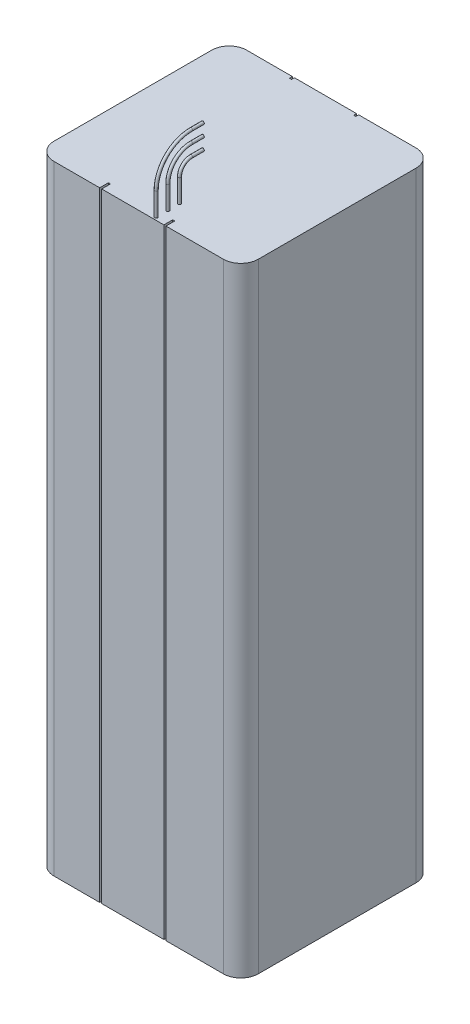
ISO-10303-21;
HEADER;
FILE_DESCRIPTION(('STEP AP214'),'2;1');
FILE_NAME('part.step','',(''),(''),'','','');
FILE_SCHEMA(('AUTOMOTIVE_DESIGN { 1 0 10303 214 1 1 1 1 }'));
ENDSEC;
DATA;
#1=APPLICATION_CONTEXT('core data for automotive mechanical design processes');
#2=APPLICATION_PROTOCOL_DEFINITION('international standard','automotive_design',2000,#1);
#3=PRODUCT_CONTEXT('',#1,'mechanical');
#4=PRODUCT('Part','Part','',(#3));
#5=PRODUCT_RELATED_PRODUCT_CATEGORY('part','',(#4));
#6=PRODUCT_DEFINITION_FORMATION('','',#4);
#7=PRODUCT_DEFINITION_CONTEXT('part definition',#1,'design');
#8=PRODUCT_DEFINITION('design','',#6,#7);
#9=PRODUCT_DEFINITION_SHAPE('','',#8);
#10=(LENGTH_UNIT() NAMED_UNIT(*) SI_UNIT(.MILLI.,.METRE.));
#11=(NAMED_UNIT(*) PLANE_ANGLE_UNIT() SI_UNIT($,.RADIAN.));
#12=(NAMED_UNIT(*) SI_UNIT($,.STERADIAN.) SOLID_ANGLE_UNIT());
#13=UNCERTAINTY_MEASURE_WITH_UNIT(LENGTH_MEASURE(1.E-05),#10,'distance_accuracy_value','');
#14=(GEOMETRIC_REPRESENTATION_CONTEXT(3) GLOBAL_UNCERTAINTY_ASSIGNED_CONTEXT((#13)) GLOBAL_UNIT_ASSIGNED_CONTEXT((#10,
#11,#12)) REPRESENTATION_CONTEXT('',''));
#15=CARTESIAN_POINT('',(0.,0.,0.));
#16=DIRECTION('',(0.,0.,1.));
#17=DIRECTION('',(1.,0.,0.));
#18=AXIS2_PLACEMENT_3D('',#15,#16,#17);
#19=CARTESIAN_POINT('',(20.,108.,-7.5));
#20=DIRECTION('',(0.,0.,1.));
#21=DIRECTION('',(1.,0.,0.));
#22=AXIS2_PLACEMENT_3D('',#19,#20,#21);
#23=PLANE('',#22);
#24=CARTESIAN_POINT('',(20.,108.,-7.5));
#25=DIRECTION('',(0.,0.,1.));
#26=DIRECTION('',(1.,0.,0.));
#27=AXIS2_PLACEMENT_3D('',#24,#25,#26);
#28=CIRCLE('',#27,0.25);
#29=CARTESIAN_POINT('',(20.25,108.,-7.5));
#30=VERTEX_POINT('',#29);
#31=EDGE_CURVE('E20',#30,#30,#28,.T.);
#32=ORIENTED_EDGE('',*,*,#31,.F.);
#33=EDGE_LOOP('',(#32));
#34=FACE_BOUND('',#33,.T.);
#35=ADVANCED_FACE('F17',(#34),#23,.F.);
#36=CARTESIAN_POINT('',(20.,106.,-7.5));
#37=DIRECTION('',(0.,0.,1.));
#38=DIRECTION('',(1.,0.,0.));
#39=AXIS2_PLACEMENT_3D('',#36,#37,#38);
#40=PLANE('',#39);
#41=CARTESIAN_POINT('',(20.,106.,-7.5));
#42=DIRECTION('',(0.,0.,1.));
#43=DIRECTION('',(1.,0.,0.));
#44=AXIS2_PLACEMENT_3D('',#41,#42,#43);
#45=CIRCLE('',#44,0.25);
#46=CARTESIAN_POINT('',(20.25,106.,-7.5));
#47=VERTEX_POINT('',#46);
#48=EDGE_CURVE('E384',#47,#47,#45,.T.);
#49=ORIENTED_EDGE('',*,*,#48,.F.);
#50=EDGE_LOOP('',(#49));
#51=FACE_BOUND('',#50,.T.);
#52=ADVANCED_FACE('F394',(#51),#40,.F.);
#53=CARTESIAN_POINT('',(20.,104.,-7.5));
#54=DIRECTION('',(0.,0.,1.));
#55=DIRECTION('',(1.,0.,0.));
#56=AXIS2_PLACEMENT_3D('',#53,#54,#55);
#57=PLANE('',#56);
#58=CARTESIAN_POINT('',(20.,104.,-7.5));
#59=DIRECTION('',(0.,0.,1.));
#60=DIRECTION('',(1.,0.,0.));
#61=AXIS2_PLACEMENT_3D('',#58,#59,#60);
#62=CIRCLE('',#61,0.25);
#63=CARTESIAN_POINT('',(20.25,104.,-7.5));
#64=VERTEX_POINT('',#63);
#65=EDGE_CURVE('E302',#64,#64,#62,.T.);
#66=ORIENTED_EDGE('',*,*,#65,.F.);
#67=EDGE_LOOP('',(#66));
#68=FACE_BOUND('',#67,.T.);
#69=ADVANCED_FACE('F399',(#68),#57,.F.);
#70=CARTESIAN_POINT('',(20.,108.,-7.5));
#71=DIRECTION('',(0.,0.,1.));
#72=DIRECTION('',(1.,0.,0.));
#73=AXIS2_PLACEMENT_3D('',#70,#71,#72);
#74=CYLINDRICAL_SURFACE('',#73,0.25);
#75=CARTESIAN_POINT('',(20.,108.,-5.5));
#76=DIRECTION('',(0.,0.,1.));
#77=DIRECTION('',(0.,1.,0.));
#78=AXIS2_PLACEMENT_3D('',#75,#76,#77);
#79=CIRCLE('',#78,0.25);
#80=CARTESIAN_POINT('',(20.,108.25,-5.5));
#81=VERTEX_POINT('',#80);
#82=EDGE_CURVE('E299',#81,#81,#79,.T.);
#83=ORIENTED_EDGE('',*,*,#82,.F.);
#84=EDGE_LOOP('',(#83));
#85=FACE_BOUND('',#84,.T.);
#86=ORIENTED_EDGE('',*,*,#31,.T.);
#87=EDGE_LOOP('',(#86));
#88=FACE_BOUND('',#87,.T.);
#89=ADVANCED_FACE('F391',(#85,#88),#74,.T.);
#90=CARTESIAN_POINT('',(20.,106.,-7.5));
#91=DIRECTION('',(0.,0.,1.));
#92=DIRECTION('',(1.,0.,0.));
#93=AXIS2_PLACEMENT_3D('',#90,#91,#92);
#94=CYLINDRICAL_SURFACE('',#93,0.25);
#95=CARTESIAN_POINT('',(20.,106.,-5.5));
#96=DIRECTION('',(0.,0.,1.));
#97=DIRECTION('',(0.,1.,0.));
#98=AXIS2_PLACEMENT_3D('',#95,#96,#97);
#99=CIRCLE('',#98,0.25);
#100=CARTESIAN_POINT('',(20.,106.25,-5.5));
#101=VERTEX_POINT('',#100);
#102=EDGE_CURVE('E296',#101,#101,#99,.T.);
#103=ORIENTED_EDGE('',*,*,#102,.F.);
#104=EDGE_LOOP('',(#103));
#105=FACE_BOUND('',#104,.T.);
#106=ORIENTED_EDGE('',*,*,#48,.T.);
#107=EDGE_LOOP('',(#106));
#108=FACE_BOUND('',#107,.T.);
#109=ADVANCED_FACE('F688',(#105,#108),#94,.T.);
#110=CARTESIAN_POINT('',(20.,104.,-7.5));
#111=DIRECTION('',(0.,0.,1.));
#112=DIRECTION('',(1.,0.,0.));
#113=AXIS2_PLACEMENT_3D('',#110,#111,#112);
#114=CYLINDRICAL_SURFACE('',#113,0.25);
#115=CARTESIAN_POINT('',(20.,104.,-5.5));
#116=DIRECTION('',(0.,0.,1.));
#117=DIRECTION('',(0.,1.,0.));
#118=AXIS2_PLACEMENT_3D('',#115,#116,#117);
#119=CIRCLE('',#118,0.25);
#120=CARTESIAN_POINT('',(20.,104.25,-5.5));
#121=VERTEX_POINT('',#120);
#122=EDGE_CURVE('E178',#121,#121,#119,.T.);
#123=ORIENTED_EDGE('',*,*,#122,.F.);
#124=EDGE_LOOP('',(#123));
#125=FACE_BOUND('',#124,.T.);
#126=ORIENTED_EDGE('',*,*,#65,.T.);
#127=EDGE_LOOP('',(#126));
#128=FACE_BOUND('',#127,.T.);
#129=ADVANCED_FACE('F683',(#125,#128),#114,.T.);
#130=CARTESIAN_POINT('',(0.,0.,-0.5));
#131=DIRECTION('',(0.,0.,1.));
#132=DIRECTION('',(1.,0.,0.));
#133=AXIS2_PLACEMENT_3D('',#130,#131,#132);
#134=PLANE('',#133);
#135=DIRECTION('',(1.,0.,0.));
#136=VECTOR('',#135,1.);
#137=CARTESIAN_POINT('',(0.,98.,-0.5));
#138=LINE('',#137,#136);
#139=CARTESIAN_POINT('',(11.175,98.,-0.5));
#140=VERTEX_POINT('',#139);
#141=CARTESIAN_POINT('',(10.825,98.,-0.5));
#142=VERTEX_POINT('',#141);
#143=EDGE_CURVE('E177',#140,#142,#138,.F.);
#144=ORIENTED_EDGE('',*,*,#143,.T.);
#145=DIRECTION('',(0.,1.,0.));
#146=VECTOR('',#145,1.);
#147=CARTESIAN_POINT('',(10.825,98.,-0.5));
#148=LINE('',#147,#146);
#149=CARTESIAN_POINT('',(10.825,-8.00000000000001,-0.5));
#150=VERTEX_POINT('',#149);
#151=EDGE_CURVE('E182',#142,#150,#148,.F.);
#152=ORIENTED_EDGE('',*,*,#151,.T.);
#153=DIRECTION('',(1.,0.,0.));
#154=VECTOR('',#153,1.);
#155=CARTESIAN_POINT('',(0.,-8.,-0.5));
#156=LINE('',#155,#154);
#157=CARTESIAN_POINT('',(11.175,-8.,-0.5));
#158=VERTEX_POINT('',#157);
#159=EDGE_CURVE('E168',#150,#158,#156,.T.);
#160=ORIENTED_EDGE('',*,*,#159,.T.);
#161=DIRECTION('',(0.,1.,0.));
#162=VECTOR('',#161,1.);
#163=CARTESIAN_POINT('',(11.175,98.,-0.5));
#164=LINE('',#163,#162);
#165=EDGE_CURVE('E192',#158,#140,#164,.T.);
#166=ORIENTED_EDGE('',*,*,#165,.T.);
#167=EDGE_LOOP('',(#144,#152,#160,#166));
#168=FACE_BOUND('',#167,.T.);
#169=ADVANCED_FACE('F183',(#168),#134,.T.);
#170=CARTESIAN_POINT('',(0.,0.,-0.5));
#171=DIRECTION('',(0.,0.,1.));
#172=DIRECTION('',(1.,0.,0.));
#173=AXIS2_PLACEMENT_3D('',#170,#171,#172);
#174=PLANE('',#173);
#175=DIRECTION('',(1.,0.,0.));
#176=VECTOR('',#175,1.);
#177=CARTESIAN_POINT('',(0.,98.,-0.5));
#178=LINE('',#177,#176);
#179=CARTESIAN_POINT('',(22.175,98.,-0.5));
#180=VERTEX_POINT('',#179);
#181=CARTESIAN_POINT('',(21.825,98.,-0.5));
#182=VERTEX_POINT('',#181);
#183=EDGE_CURVE('E248',#180,#182,#178,.F.);
#184=ORIENTED_EDGE('',*,*,#183,.T.);
#185=DIRECTION('',(0.,1.,0.));
#186=VECTOR('',#185,1.);
#187=CARTESIAN_POINT('',(21.825,98.,-0.5));
#188=LINE('',#187,#186);
#189=CARTESIAN_POINT('',(21.825,-8.,-0.5));
#190=VERTEX_POINT('',#189);
#191=EDGE_CURVE('E318',#182,#190,#188,.F.);
#192=ORIENTED_EDGE('',*,*,#191,.T.);
#193=DIRECTION('',(1.,0.,0.));
#194=VECTOR('',#193,1.);
#195=CARTESIAN_POINT('',(0.,-8.,-0.5));
#196=LINE('',#195,#194);
#197=CARTESIAN_POINT('',(22.175,-8.00000000000001,-0.5));
#198=VERTEX_POINT('',#197);
#199=EDGE_CURVE('E263',#190,#198,#196,.T.);
#200=ORIENTED_EDGE('',*,*,#199,.T.);
#201=DIRECTION('',(0.,1.,0.));
#202=VECTOR('',#201,1.);
#203=CARTESIAN_POINT('',(22.175,98.,-0.5));
#204=LINE('',#203,#202);
#205=EDGE_CURVE('E254',#198,#180,#204,.T.);
#206=ORIENTED_EDGE('',*,*,#205,.T.);
#207=EDGE_LOOP('',(#184,#192,#200,#206));
#208=FACE_BOUND('',#207,.T.);
#209=ADVANCED_FACE('F657',(#208),#174,.T.);
#210=CARTESIAN_POINT('',(0.,0.,-31.5));
#211=DIRECTION('',(0.,0.,-1.));
#212=DIRECTION('',(-1.,0.,0.));
#213=AXIS2_PLACEMENT_3D('',#210,#211,#212);
#214=PLANE('',#213);
#215=DIRECTION('',(-1.,0.,0.));
#216=VECTOR('',#215,1.);
#217=CARTESIAN_POINT('',(0.,-8.,-31.5));
#218=LINE('',#217,#216);
#219=CARTESIAN_POINT('',(22.175,-8.00000000000001,-31.5));
#220=VERTEX_POINT('',#219);
#221=CARTESIAN_POINT('',(21.825,-8.,-31.5));
#222=VERTEX_POINT('',#221);
#223=EDGE_CURVE('E213',#220,#222,#218,.T.);
#224=ORIENTED_EDGE('',*,*,#223,.T.);
#225=DIRECTION('',(0.,1.,0.));
#226=VECTOR('',#225,1.);
#227=CARTESIAN_POINT('',(21.825,98.,-31.5));
#228=LINE('',#227,#226);
#229=CARTESIAN_POINT('',(21.825,98.,-31.5));
#230=VERTEX_POINT('',#229);
#231=EDGE_CURVE('E304',#230,#222,#228,.F.);
#232=ORIENTED_EDGE('',*,*,#231,.F.);
#233=DIRECTION('',(-1.,0.,0.));
#234=VECTOR('',#233,1.);
#235=CARTESIAN_POINT('',(0.,98.,-31.5));
#236=LINE('',#235,#234);
#237=CARTESIAN_POINT('',(22.175,98.,-31.5));
#238=VERTEX_POINT('',#237);
#239=EDGE_CURVE('E246',#230,#238,#236,.F.);
#240=ORIENTED_EDGE('',*,*,#239,.T.);
#241=DIRECTION('',(0.,1.,0.));
#242=VECTOR('',#241,1.);
#243=CARTESIAN_POINT('',(22.175,98.,-31.5));
#244=LINE('',#243,#242);
#245=EDGE_CURVE('E240',#220,#238,#244,.T.);
#246=ORIENTED_EDGE('',*,*,#245,.F.);
#247=EDGE_LOOP('',(#224,#232,#240,#246));
#248=FACE_BOUND('',#247,.T.);
#249=ADVANCED_FACE('F235',(#248),#214,.T.);
#250=CARTESIAN_POINT('',(20.,102.,-5.5));
#251=DIRECTION('',(1.,0.,0.));
#252=DIRECTION('',(0.,-1.,0.));
#253=AXIS2_PLACEMENT_3D('',#250,#251,#252);
#254=TOROIDAL_SURFACE('',#253,6.00000000000001,0.25);
#255=CARTESIAN_POINT('',(20.,102.,0.5));
#256=DIRECTION('',(0.,-1.,0.));
#257=DIRECTION('',(0.,0.,-1.));
#258=AXIS2_PLACEMENT_3D('',#255,#256,#257);
#259=CIRCLE('',#258,0.25);
#260=CARTESIAN_POINT('',(20.,102.,0.25));
#261=VERTEX_POINT('',#260);
#262=EDGE_CURVE('E291',#261,#261,#259,.T.);
#263=ORIENTED_EDGE('',*,*,#262,.F.);
#264=EDGE_LOOP('',(#263));
#265=FACE_BOUND('',#264,.T.);
#266=ORIENTED_EDGE('',*,*,#82,.T.);
#267=EDGE_LOOP('',(#266));
#268=FACE_BOUND('',#267,.T.);
#269=ADVANCED_FACE('F231',(#265,#268),#254,.T.);
#270=CARTESIAN_POINT('',(20.,102.,-5.5));
#271=DIRECTION('',(1.,0.,0.));
#272=DIRECTION('',(0.,-1.,0.));
#273=AXIS2_PLACEMENT_3D('',#270,#271,#272);
#274=TOROIDAL_SURFACE('',#273,4.,0.25);
#275=CARTESIAN_POINT('',(20.,102.,-1.5));
#276=DIRECTION('',(0.,-1.,0.));
#277=DIRECTION('',(0.,0.,-1.));
#278=AXIS2_PLACEMENT_3D('',#275,#276,#277);
#279=CIRCLE('',#278,0.25);
#280=CARTESIAN_POINT('',(20.,102.,-1.75));
#281=VERTEX_POINT('',#280);
#282=EDGE_CURVE('E522',#281,#281,#279,.T.);
#283=ORIENTED_EDGE('',*,*,#282,.F.);
#284=EDGE_LOOP('',(#283));
#285=FACE_BOUND('',#284,.T.);
#286=ORIENTED_EDGE('',*,*,#102,.T.);
#287=EDGE_LOOP('',(#286));
#288=FACE_BOUND('',#287,.T.);
#289=ADVANCED_FACE('F226',(#285,#288),#274,.T.);
#290=CARTESIAN_POINT('',(20.,102.,-5.5));
#291=DIRECTION('',(1.,0.,0.));
#292=DIRECTION('',(0.,-1.,0.));
#293=AXIS2_PLACEMENT_3D('',#290,#291,#292);
#294=TOROIDAL_SURFACE('',#293,2.,0.25);
#295=CARTESIAN_POINT('',(20.,102.,-3.5));
#296=DIRECTION('',(0.,-1.,0.));
#297=DIRECTION('',(0.,0.,-1.));
#298=AXIS2_PLACEMENT_3D('',#295,#296,#297);
#299=CIRCLE('',#298,0.25);
#300=CARTESIAN_POINT('',(20.,102.,-3.75));
#301=VERTEX_POINT('',#300);
#302=EDGE_CURVE('E519',#301,#301,#299,.T.);
#303=ORIENTED_EDGE('',*,*,#302,.F.);
#304=EDGE_LOOP('',(#303));
#305=FACE_BOUND('',#304,.T.);
#306=ORIENTED_EDGE('',*,*,#122,.T.);
#307=EDGE_LOOP('',(#306));
#308=FACE_BOUND('',#307,.T.);
#309=ADVANCED_FACE('F221',(#305,#308),#294,.T.);
#310=CARTESIAN_POINT('',(0.,0.,-31.5));
#311=DIRECTION('',(0.,0.,-1.));
#312=DIRECTION('',(-1.,0.,0.));
#313=AXIS2_PLACEMENT_3D('',#310,#311,#312);
#314=PLANE('',#313);
#315=DIRECTION('',(-1.,0.,0.));
#316=VECTOR('',#315,1.);
#317=CARTESIAN_POINT('',(0.,-8.,-31.5));
#318=LINE('',#317,#316);
#319=CARTESIAN_POINT('',(11.175,-8.,-31.5));
#320=VERTEX_POINT('',#319);
#321=CARTESIAN_POINT('',(10.825,-8.00000000000001,-31.5));
#322=VERTEX_POINT('',#321);
#323=EDGE_CURVE('E207',#320,#322,#318,.T.);
#324=ORIENTED_EDGE('',*,*,#323,.T.);
#325=DIRECTION('',(0.,1.,0.));
#326=VECTOR('',#325,1.);
#327=CARTESIAN_POINT('',(10.825,98.,-31.5));
#328=LINE('',#327,#326);
#329=CARTESIAN_POINT('',(10.825,98.,-31.5));
#330=VERTEX_POINT('',#329);
#331=EDGE_CURVE('E200',#330,#322,#328,.F.);
#332=ORIENTED_EDGE('',*,*,#331,.F.);
#333=DIRECTION('',(-1.,0.,0.));
#334=VECTOR('',#333,1.);
#335=CARTESIAN_POINT('',(0.,98.,-31.5));
#336=LINE('',#335,#334);
#337=CARTESIAN_POINT('',(11.175,98.,-31.5));
#338=VERTEX_POINT('',#337);
#339=EDGE_CURVE('E209',#330,#338,#336,.F.);
#340=ORIENTED_EDGE('',*,*,#339,.T.);
#341=DIRECTION('',(0.,1.,0.));
#342=VECTOR('',#341,1.);
#343=CARTESIAN_POINT('',(11.175,98.,-31.5));
#344=LINE('',#343,#342);
#345=EDGE_CURVE('E277',#320,#338,#344,.T.);
#346=ORIENTED_EDGE('',*,*,#345,.F.);
#347=EDGE_LOOP('',(#324,#332,#340,#346));
#348=FACE_BOUND('',#347,.T.);
#349=ADVANCED_FACE('F225',(#348),#314,.T.);
#350=CARTESIAN_POINT('',(10.825,98.,-0.5));
#351=DIRECTION('',(-1.,0.,0.));
#352=DIRECTION('',(0.,0.,1.));
#353=AXIS2_PLACEMENT_3D('',#350,#351,#352);
#354=PLANE('',#353);
#355=ORIENTED_EDGE('',*,*,#151,.F.);
#356=DIRECTION('',(0.,0.,1.));
#357=VECTOR('',#356,1.);
#358=CARTESIAN_POINT('',(10.825,98.,-0.5));
#359=LINE('',#358,#357);
#360=CARTESIAN_POINT('',(10.825,98.,1.));
#361=VERTEX_POINT('',#360);
#362=EDGE_CURVE('E185',#361,#142,#359,.F.);
#363=ORIENTED_EDGE('',*,*,#362,.F.);
#364=DIRECTION('',(0.,1.,0.));
#365=VECTOR('',#364,1.);
#366=CARTESIAN_POINT('',(10.825,0.,1.));
#367=LINE('',#366,#365);
#368=CARTESIAN_POINT('',(10.825,-8.,1.));
#369=VERTEX_POINT('',#368);
#370=EDGE_CURVE('E189',#361,#369,#367,.F.);
#371=ORIENTED_EDGE('',*,*,#370,.T.);
#372=DIRECTION('',(0.,0.,1.));
#373=VECTOR('',#372,1.);
#374=CARTESIAN_POINT('',(10.825,-8.00000000000001,-0.5));
#375=LINE('',#374,#373);
#376=EDGE_CURVE('E172',#150,#369,#375,.T.);
#377=ORIENTED_EDGE('',*,*,#376,.F.);
#378=EDGE_LOOP('',(#355,#363,#371,#377));
#379=FACE_BOUND('',#378,.T.);
#380=ADVANCED_FACE('F187',(#379),#354,.F.);
#381=CARTESIAN_POINT('',(11.175,98.,-0.5));
#382=DIRECTION('',(1.,0.,0.));
#383=DIRECTION('',(0.,0.,-1.));
#384=AXIS2_PLACEMENT_3D('',#381,#382,#383);
#385=PLANE('',#384);
#386=ORIENTED_EDGE('',*,*,#165,.F.);
#387=DIRECTION('',(0.,0.,-1.));
#388=VECTOR('',#387,1.);
#389=CARTESIAN_POINT('',(11.175,-8.00000000000001,-0.5));
#390=LINE('',#389,#388);
#391=CARTESIAN_POINT('',(11.175,-8.,1.));
#392=VERTEX_POINT('',#391);
#393=EDGE_CURVE('E166',#392,#158,#390,.T.);
#394=ORIENTED_EDGE('',*,*,#393,.F.);
#395=DIRECTION('',(0.,1.,0.));
#396=VECTOR('',#395,1.);
#397=CARTESIAN_POINT('',(11.175,0.,1.));
#398=LINE('',#397,#396);
#399=CARTESIAN_POINT('',(11.175,98.,1.));
#400=VERTEX_POINT('',#399);
#401=EDGE_CURVE('E550',#392,#400,#398,.T.);
#402=ORIENTED_EDGE('',*,*,#401,.T.);
#403=DIRECTION('',(0.,0.,-1.));
#404=VECTOR('',#403,1.);
#405=CARTESIAN_POINT('',(11.175,98.,-0.5));
#406=LINE('',#405,#404);
#407=EDGE_CURVE('E319',#140,#400,#406,.F.);
#408=ORIENTED_EDGE('',*,*,#407,.F.);
#409=EDGE_LOOP('',(#386,#394,#402,#408));
#410=FACE_BOUND('',#409,.T.);
#411=ADVANCED_FACE('F493',(#410),#385,.F.);
#412=CARTESIAN_POINT('',(21.825,98.,-0.5));
#413=DIRECTION('',(-1.,0.,0.));
#414=DIRECTION('',(0.,0.,1.));
#415=AXIS2_PLACEMENT_3D('',#412,#413,#414);
#416=PLANE('',#415);
#417=ORIENTED_EDGE('',*,*,#191,.F.);
#418=DIRECTION('',(0.,0.,1.));
#419=VECTOR('',#418,1.);
#420=CARTESIAN_POINT('',(21.825,98.,-0.5));
#421=LINE('',#420,#419);
#422=CARTESIAN_POINT('',(21.825,98.,1.));
#423=VERTEX_POINT('',#422);
#424=EDGE_CURVE('E316',#423,#182,#421,.F.);
#425=ORIENTED_EDGE('',*,*,#424,.F.);
#426=DIRECTION('',(0.,1.,0.));
#427=VECTOR('',#426,1.);
#428=CARTESIAN_POINT('',(21.825,0.,1.));
#429=LINE('',#428,#427);
#430=CARTESIAN_POINT('',(21.825,-8.,1.));
#431=VERTEX_POINT('',#430);
#432=EDGE_CURVE('E553',#423,#431,#429,.F.);
#433=ORIENTED_EDGE('',*,*,#432,.T.);
#434=DIRECTION('',(0.,0.,1.));
#435=VECTOR('',#434,1.);
#436=CARTESIAN_POINT('',(21.825,-8.00000000000001,-0.5));
#437=LINE('',#436,#435);
#438=EDGE_CURVE('E324',#190,#431,#437,.T.);
#439=ORIENTED_EDGE('',*,*,#438,.F.);
#440=EDGE_LOOP('',(#417,#425,#433,#439));
#441=FACE_BOUND('',#440,.T.);
#442=ADVANCED_FACE('F489',(#441),#416,.F.);
#443=CARTESIAN_POINT('',(22.175,98.,-0.5));
#444=DIRECTION('',(1.,0.,0.));
#445=DIRECTION('',(0.,0.,-1.));
#446=AXIS2_PLACEMENT_3D('',#443,#444,#445);
#447=PLANE('',#446);
#448=ORIENTED_EDGE('',*,*,#205,.F.);
#449=DIRECTION('',(0.,0.,-1.));
#450=VECTOR('',#449,1.);
#451=CARTESIAN_POINT('',(22.175,-8.00000000000001,-0.5));
#452=LINE('',#451,#450);
#453=CARTESIAN_POINT('',(22.175,-8.,1.));
#454=VERTEX_POINT('',#453);
#455=EDGE_CURVE('E258',#454,#198,#452,.T.);
#456=ORIENTED_EDGE('',*,*,#455,.F.);
#457=DIRECTION('',(0.,1.,0.));
#458=VECTOR('',#457,1.);
#459=CARTESIAN_POINT('',(22.175,0.,1.));
#460=LINE('',#459,#458);
#461=CARTESIAN_POINT('',(22.175,98.,1.));
#462=VERTEX_POINT('',#461);
#463=EDGE_CURVE('E559',#454,#462,#460,.T.);
#464=ORIENTED_EDGE('',*,*,#463,.T.);
#465=DIRECTION('',(0.,0.,-1.));
#466=VECTOR('',#465,1.);
#467=CARTESIAN_POINT('',(22.175,98.,-0.5));
#468=LINE('',#467,#466);
#469=EDGE_CURVE('E257',#180,#462,#468,.F.);
#470=ORIENTED_EDGE('',*,*,#469,.F.);
#471=EDGE_LOOP('',(#448,#456,#464,#470));
#472=FACE_BOUND('',#471,.T.);
#473=ADVANCED_FACE('F485',(#472),#447,.F.);
#474=CARTESIAN_POINT('',(22.175,98.,-31.5));
#475=DIRECTION('',(-1.,0.,0.));
#476=DIRECTION('',(0.,0.,1.));
#477=AXIS2_PLACEMENT_3D('',#474,#475,#476);
#478=PLANE('',#477);
#479=DIRECTION('',(0.,0.,1.));
#480=VECTOR('',#479,1.);
#481=CARTESIAN_POINT('',(22.175,98.,-31.5));
#482=LINE('',#481,#480);
#483=CARTESIAN_POINT('',(22.175,98.,-32.));
#484=VERTEX_POINT('',#483);
#485=EDGE_CURVE('E243',#238,#484,#482,.F.);
#486=ORIENTED_EDGE('',*,*,#485,.T.);
#487=DIRECTION('',(0.,1.,0.));
#488=VECTOR('',#487,1.);
#489=CARTESIAN_POINT('',(22.175,0.,-32.));
#490=LINE('',#489,#488);
#491=CARTESIAN_POINT('',(22.175,-8.,-32.));
#492=VERTEX_POINT('',#491);
#493=EDGE_CURVE('E570',#492,#484,#490,.T.);
#494=ORIENTED_EDGE('',*,*,#493,.F.);
#495=DIRECTION('',(0.,0.,1.));
#496=VECTOR('',#495,1.);
#497=CARTESIAN_POINT('',(22.175,-8.00000000000001,-31.5));
#498=LINE('',#497,#496);
#499=EDGE_CURVE('E100',#492,#220,#498,.T.);
#500=ORIENTED_EDGE('',*,*,#499,.T.);
#501=ORIENTED_EDGE('',*,*,#245,.T.);
#502=EDGE_LOOP('',(#486,#494,#500,#501));
#503=FACE_BOUND('',#502,.T.);
#504=ADVANCED_FACE('F481',(#503),#478,.T.);
#505=CARTESIAN_POINT('',(21.825,98.,-31.5));
#506=DIRECTION('',(1.,0.,0.));
#507=DIRECTION('',(0.,0.,-1.));
#508=AXIS2_PLACEMENT_3D('',#505,#506,#507);
#509=PLANE('',#508);
#510=DIRECTION('',(0.,0.,-1.));
#511=VECTOR('',#510,1.);
#512=CARTESIAN_POINT('',(21.825,-8.00000000000001,-31.5));
#513=LINE('',#512,#511);
#514=CARTESIAN_POINT('',(21.825,-8.,-32.));
#515=VERTEX_POINT('',#514);
#516=EDGE_CURVE('E286',#222,#515,#513,.T.);
#517=ORIENTED_EDGE('',*,*,#516,.T.);
#518=DIRECTION('',(0.,1.,0.));
#519=VECTOR('',#518,1.);
#520=CARTESIAN_POINT('',(21.825,0.,-32.));
#521=LINE('',#520,#519);
#522=CARTESIAN_POINT('',(21.825,98.,-32.));
#523=VERTEX_POINT('',#522);
#524=EDGE_CURVE('E576',#523,#515,#521,.F.);
#525=ORIENTED_EDGE('',*,*,#524,.F.);
#526=DIRECTION('',(0.,0.,-1.));
#527=VECTOR('',#526,1.);
#528=CARTESIAN_POINT('',(21.825,98.,-31.5));
#529=LINE('',#528,#527);
#530=EDGE_CURVE('E309',#523,#230,#529,.F.);
#531=ORIENTED_EDGE('',*,*,#530,.T.);
#532=ORIENTED_EDGE('',*,*,#231,.T.);
#533=EDGE_LOOP('',(#517,#525,#531,#532));
#534=FACE_BOUND('',#533,.T.);
#535=ADVANCED_FACE('F477',(#534),#509,.T.);
#536=CARTESIAN_POINT('',(11.175,98.,-31.5));
#537=DIRECTION('',(-1.,0.,0.));
#538=DIRECTION('',(0.,0.,1.));
#539=AXIS2_PLACEMENT_3D('',#536,#537,#538);
#540=PLANE('',#539);
#541=DIRECTION('',(0.,0.,1.));
#542=VECTOR('',#541,1.);
#543=CARTESIAN_POINT('',(11.175,98.,-31.5));
#544=LINE('',#543,#542);
#545=CARTESIAN_POINT('',(11.175,98.,-32.));
#546=VERTEX_POINT('',#545);
#547=EDGE_CURVE('E280',#338,#546,#544,.F.);
#548=ORIENTED_EDGE('',*,*,#547,.T.);
#549=DIRECTION('',(0.,1.,0.));
#550=VECTOR('',#549,1.);
#551=CARTESIAN_POINT('',(11.175,0.,-32.));
#552=LINE('',#551,#550);
#553=CARTESIAN_POINT('',(11.175,-8.,-32.));
#554=VERTEX_POINT('',#553);
#555=EDGE_CURVE('E579',#554,#546,#552,.T.);
#556=ORIENTED_EDGE('',*,*,#555,.F.);
#557=DIRECTION('',(0.,0.,1.));
#558=VECTOR('',#557,1.);
#559=CARTESIAN_POINT('',(11.175,-8.00000000000001,-31.5));
#560=LINE('',#559,#558);
#561=EDGE_CURVE('E281',#554,#320,#560,.T.);
#562=ORIENTED_EDGE('',*,*,#561,.T.);
#563=ORIENTED_EDGE('',*,*,#345,.T.);
#564=EDGE_LOOP('',(#548,#556,#562,#563));
#565=FACE_BOUND('',#564,.T.);
#566=ADVANCED_FACE('F473',(#565),#540,.T.);
#567=CARTESIAN_POINT('',(10.825,98.,-31.5));
#568=DIRECTION('',(1.,0.,0.));
#569=DIRECTION('',(0.,0.,-1.));
#570=AXIS2_PLACEMENT_3D('',#567,#568,#569);
#571=PLANE('',#570);
#572=DIRECTION('',(0.,0.,-1.));
#573=VECTOR('',#572,1.);
#574=CARTESIAN_POINT('',(10.825,-8.00000000000001,-31.5));
#575=LINE('',#574,#573);
#576=CARTESIAN_POINT('',(10.825,-8.,-32.));
#577=VERTEX_POINT('',#576);
#578=EDGE_CURVE('E203',#322,#577,#575,.T.);
#579=ORIENTED_EDGE('',*,*,#578,.T.);
#580=DIRECTION('',(0.,1.,0.));
#581=VECTOR('',#580,1.);
#582=CARTESIAN_POINT('',(10.825,0.,-32.));
#583=LINE('',#582,#581);
#584=CARTESIAN_POINT('',(10.825,98.,-32.));
#585=VERTEX_POINT('',#584);
#586=EDGE_CURVE('E517',#585,#577,#583,.F.);
#587=ORIENTED_EDGE('',*,*,#586,.F.);
#588=DIRECTION('',(0.,0.,-1.));
#589=VECTOR('',#588,1.);
#590=CARTESIAN_POINT('',(10.825,98.,-31.5));
#591=LINE('',#590,#589);
#592=EDGE_CURVE('E204',#585,#330,#591,.F.);
#593=ORIENTED_EDGE('',*,*,#592,.T.);
#594=ORIENTED_EDGE('',*,*,#331,.T.);
#595=EDGE_LOOP('',(#579,#587,#593,#594));
#596=FACE_BOUND('',#595,.T.);
#597=ADVANCED_FACE('F469',(#596),#571,.T.);
#598=CARTESIAN_POINT('',(0.,0.,1.));
#599=DIRECTION('',(0.,0.,-1.));
#600=DIRECTION('',(-1.,0.,0.));
#601=AXIS2_PLACEMENT_3D('',#598,#599,#600);
#602=PLANE('',#601);
#603=ORIENTED_EDGE('',*,*,#370,.F.);
#604=DIRECTION('',(1.,0.,0.));
#605=VECTOR('',#604,1.);
#606=CARTESIAN_POINT('',(0.,98.,1.));
#607=LINE('',#606,#605);
#608=CARTESIAN_POINT('',(3.,98.,1.));
#609=VERTEX_POINT('',#608);
#610=EDGE_CURVE('E368',#609,#361,#607,.T.);
#611=ORIENTED_EDGE('',*,*,#610,.F.);
#612=DIRECTION('',(0.,1.,0.));
#613=VECTOR('',#612,1.);
#614=CARTESIAN_POINT('',(3.,-146.1816,1.));
#615=LINE('',#614,#613);
#616=CARTESIAN_POINT('',(3.,-8.00000000000001,1.));
#617=VERTEX_POINT('',#616);
#618=EDGE_CURVE('E369',#617,#609,#615,.T.);
#619=ORIENTED_EDGE('',*,*,#618,.F.);
#620=DIRECTION('',(1.,0.,0.));
#621=VECTOR('',#620,1.);
#622=CARTESIAN_POINT('',(0.,-8.,1.));
#623=LINE('',#622,#621);
#624=EDGE_CURVE('E373',#369,#617,#623,.F.);
#625=ORIENTED_EDGE('',*,*,#624,.F.);
#626=EDGE_LOOP('',(#603,#611,#619,#625));
#627=FACE_BOUND('',#626,.T.);
#628=ADVANCED_FACE('F465',(#627),#602,.F.);
#629=CARTESIAN_POINT('',(0.,0.,1.));
#630=DIRECTION('',(0.,0.,-1.));
#631=DIRECTION('',(-1.,0.,0.));
#632=AXIS2_PLACEMENT_3D('',#629,#630,#631);
#633=PLANE('',#632);
#634=DIRECTION('',(1.,0.,0.));
#635=VECTOR('',#634,1.);
#636=CARTESIAN_POINT('',(0.,98.,1.));
#637=LINE('',#636,#635);
#638=EDGE_CURVE('E616',#400,#423,#637,.T.);
#639=ORIENTED_EDGE('',*,*,#638,.F.);
#640=ORIENTED_EDGE('',*,*,#401,.F.);
#641=DIRECTION('',(1.,0.,0.));
#642=VECTOR('',#641,1.);
#643=CARTESIAN_POINT('',(0.,-8.,1.));
#644=LINE('',#643,#642);
#645=EDGE_CURVE('E602',#431,#392,#644,.F.);
#646=ORIENTED_EDGE('',*,*,#645,.F.);
#647=ORIENTED_EDGE('',*,*,#432,.F.);
#648=EDGE_LOOP('',(#639,#640,#646,#647));
#649=FACE_BOUND('',#648,.T.);
#650=ADVANCED_FACE('F461',(#649),#633,.F.);
#651=CARTESIAN_POINT('',(0.,0.,1.));
#652=DIRECTION('',(0.,0.,-1.));
#653=DIRECTION('',(-1.,0.,0.));
#654=AXIS2_PLACEMENT_3D('',#651,#652,#653);
#655=PLANE('',#654);
#656=ORIENTED_EDGE('',*,*,#463,.F.);
#657=DIRECTION('',(1.,0.,0.));
#658=VECTOR('',#657,1.);
#659=CARTESIAN_POINT('',(0.,-8.,1.));
#660=LINE('',#659,#658);
#661=CARTESIAN_POINT('',(32.,-8.00000000000001,1.));
#662=VERTEX_POINT('',#661);
#663=EDGE_CURVE('E377',#662,#454,#660,.F.);
#664=ORIENTED_EDGE('',*,*,#663,.F.);
#665=DIRECTION('',(0.,-1.,0.));
#666=VECTOR('',#665,1.);
#667=CARTESIAN_POINT('',(32.,236.1816,1.));
#668=LINE('',#667,#666);
#669=CARTESIAN_POINT('',(32.,98.,1.));
#670=VERTEX_POINT('',#669);
#671=EDGE_CURVE('E564',#670,#662,#668,.T.);
#672=ORIENTED_EDGE('',*,*,#671,.F.);
#673=DIRECTION('',(1.,0.,0.));
#674=VECTOR('',#673,1.);
#675=CARTESIAN_POINT('',(0.,98.,1.));
#676=LINE('',#675,#674);
#677=EDGE_CURVE('E364',#462,#670,#676,.T.);
#678=ORIENTED_EDGE('',*,*,#677,.F.);
#679=EDGE_LOOP('',(#656,#664,#672,#678));
#680=FACE_BOUND('',#679,.T.);
#681=ADVANCED_FACE('F457',(#680),#655,.F.);
#682=CARTESIAN_POINT('',(32.,236.1816,-2.));
#683=DIRECTION('',(0.,-1.,0.));
#684=DIRECTION('',(0.,0.,-1.));
#685=AXIS2_PLACEMENT_3D('',#682,#683,#684);
#686=CYLINDRICAL_SURFACE('',#685,3.);
#687=ORIENTED_EDGE('',*,*,#671,.T.);
#688=CARTESIAN_POINT('',(32.,-8.00000000000001,-2.));
#689=DIRECTION('',(0.,-1.,0.));
#690=DIRECTION('',(0.,0.,-1.));
#691=AXIS2_PLACEMENT_3D('',#688,#689,#690);
#692=CIRCLE('',#691,3.);
#693=CARTESIAN_POINT('',(35.,-8.,-2.));
#694=VERTEX_POINT('',#693);
#695=EDGE_CURVE('E374',#694,#662,#692,.T.);
#696=ORIENTED_EDGE('',*,*,#695,.F.);
#697=DIRECTION('',(0.,1.,0.));
#698=VECTOR('',#697,1.);
#699=CARTESIAN_POINT('',(35.,0.,-2.));
#700=LINE('',#699,#698);
#701=CARTESIAN_POINT('',(35.,98.,-2.));
#702=VERTEX_POINT('',#701);
#703=EDGE_CURVE('E566',#702,#694,#700,.F.);
#704=ORIENTED_EDGE('',*,*,#703,.F.);
#705=CARTESIAN_POINT('',(32.,98.,-2.));
#706=DIRECTION('',(0.,-1.,0.));
#707=DIRECTION('',(0.,0.,-1.));
#708=AXIS2_PLACEMENT_3D('',#705,#706,#707);
#709=CIRCLE('',#708,3.);
#710=EDGE_CURVE('E361',#670,#702,#709,.F.);
#711=ORIENTED_EDGE('',*,*,#710,.F.);
#712=EDGE_LOOP('',(#687,#696,#704,#711));
#713=FACE_BOUND('',#712,.T.);
#714=ADVANCED_FACE('F453',(#713),#686,.T.);
#715=CARTESIAN_POINT('',(35.,0.,-32.));
#716=DIRECTION('',(1.,0.,0.));
#717=DIRECTION('',(0.,0.,-1.));
#718=AXIS2_PLACEMENT_3D('',#715,#716,#717);
#719=PLANE('',#718);
#720=DIRECTION('',(0.,0.,-1.));
#721=VECTOR('',#720,1.);
#722=CARTESIAN_POINT('',(35.,-8.,-32.));
#723=LINE('',#722,#721);
#724=CARTESIAN_POINT('',(35.,-8.00000000000001,-29.));
#725=VERTEX_POINT('',#724);
#726=EDGE_CURVE('E378',#725,#694,#723,.F.);
#727=ORIENTED_EDGE('',*,*,#726,.F.);
#728=DIRECTION('',(0.,-1.,0.));
#729=VECTOR('',#728,1.);
#730=CARTESIAN_POINT('',(35.,236.1816,-29.));
#731=LINE('',#730,#729);
#732=CARTESIAN_POINT('',(35.,98.,-29.));
#733=VERTEX_POINT('',#732);
#734=EDGE_CURVE('E568',#733,#725,#731,.T.);
#735=ORIENTED_EDGE('',*,*,#734,.F.);
#736=DIRECTION('',(0.,0.,1.));
#737=VECTOR('',#736,1.);
#738=CARTESIAN_POINT('',(35.,98.,-32.));
#739=LINE('',#738,#737);
#740=EDGE_CURVE('E360',#702,#733,#739,.F.);
#741=ORIENTED_EDGE('',*,*,#740,.F.);
#742=ORIENTED_EDGE('',*,*,#703,.T.);
#743=EDGE_LOOP('',(#727,#735,#741,#742));
#744=FACE_BOUND('',#743,.T.);
#745=ADVANCED_FACE('F449',(#744),#719,.T.);
#746=CARTESIAN_POINT('',(32.,236.1816,-29.));
#747=DIRECTION('',(0.,-1.,0.));
#748=DIRECTION('',(0.,0.,-1.));
#749=AXIS2_PLACEMENT_3D('',#746,#747,#748);
#750=CYLINDRICAL_SURFACE('',#749,3.);
#751=ORIENTED_EDGE('',*,*,#734,.T.);
#752=CARTESIAN_POINT('',(32.,-8.00000000000001,-29.));
#753=DIRECTION('',(0.,-1.,0.));
#754=DIRECTION('',(0.,0.,-1.));
#755=AXIS2_PLACEMENT_3D('',#752,#753,#754);
#756=CIRCLE('',#755,3.);
#757=CARTESIAN_POINT('',(32.,-8.,-32.));
#758=VERTEX_POINT('',#757);
#759=EDGE_CURVE('E379',#758,#725,#756,.T.);
#760=ORIENTED_EDGE('',*,*,#759,.F.);
#761=DIRECTION('',(0.,1.,0.));
#762=VECTOR('',#761,1.);
#763=CARTESIAN_POINT('',(32.,0.,-32.));
#764=LINE('',#763,#762);
#765=CARTESIAN_POINT('',(32.,98.,-32.));
#766=VERTEX_POINT('',#765);
#767=EDGE_CURVE('E90',#766,#758,#764,.F.);
#768=ORIENTED_EDGE('',*,*,#767,.F.);
#769=CARTESIAN_POINT('',(32.,98.,-29.));
#770=DIRECTION('',(0.,-1.,0.));
#771=DIRECTION('',(0.,0.,-1.));
#772=AXIS2_PLACEMENT_3D('',#769,#770,#771);
#773=CIRCLE('',#772,3.);
#774=EDGE_CURVE('E356',#733,#766,#773,.F.);
#775=ORIENTED_EDGE('',*,*,#774,.F.);
#776=EDGE_LOOP('',(#751,#760,#768,#775));
#777=FACE_BOUND('',#776,.T.);
#778=ADVANCED_FACE('F446',(#777),#750,.T.);
#779=CARTESIAN_POINT('',(0.,0.,-32.));
#780=DIRECTION('',(0.,0.,-1.));
#781=DIRECTION('',(-1.,0.,0.));
#782=AXIS2_PLACEMENT_3D('',#779,#780,#781);
#783=PLANE('',#782);
#784=DIRECTION('',(1.,0.,0.));
#785=VECTOR('',#784,1.);
#786=CARTESIAN_POINT('',(0.,98.,-32.));
#787=LINE('',#786,#785);
#788=EDGE_CURVE('E359',#766,#484,#787,.F.);
#789=ORIENTED_EDGE('',*,*,#788,.F.);
#790=ORIENTED_EDGE('',*,*,#767,.T.);
#791=DIRECTION('',(1.,0.,0.));
#792=VECTOR('',#791,1.);
#793=CARTESIAN_POINT('',(0.,-8.,-32.));
#794=LINE('',#793,#792);
#795=EDGE_CURVE('E382',#492,#758,#794,.T.);
#796=ORIENTED_EDGE('',*,*,#795,.F.);
#797=ORIENTED_EDGE('',*,*,#493,.T.);
#798=EDGE_LOOP('',(#789,#790,#796,#797));
#799=FACE_BOUND('',#798,.T.);
#800=ADVANCED_FACE('F442',(#799),#783,.T.);
#801=CARTESIAN_POINT('',(0.,0.,-32.));
#802=DIRECTION('',(0.,0.,-1.));
#803=DIRECTION('',(-1.,0.,0.));
#804=AXIS2_PLACEMENT_3D('',#801,#802,#803);
#805=PLANE('',#804);
#806=ORIENTED_EDGE('',*,*,#555,.T.);
#807=DIRECTION('',(1.,0.,0.));
#808=VECTOR('',#807,1.);
#809=CARTESIAN_POINT('',(0.,98.,-32.));
#810=LINE('',#809,#808);
#811=EDGE_CURVE('E629',#523,#546,#810,.F.);
#812=ORIENTED_EDGE('',*,*,#811,.F.);
#813=ORIENTED_EDGE('',*,*,#524,.T.);
#814=DIRECTION('',(1.,0.,0.));
#815=VECTOR('',#814,1.);
#816=CARTESIAN_POINT('',(0.,-8.,-32.));
#817=LINE('',#816,#815);
#818=EDGE_CURVE('E590',#554,#515,#817,.T.);
#819=ORIENTED_EDGE('',*,*,#818,.F.);
#820=EDGE_LOOP('',(#806,#812,#813,#819));
#821=FACE_BOUND('',#820,.T.);
#822=ADVANCED_FACE('F438',(#821),#805,.T.);
#823=CARTESIAN_POINT('',(20.,102.,0.5));
#824=DIRECTION('',(0.,-1.,0.));
#825=DIRECTION('',(0.,0.,-1.));
#826=AXIS2_PLACEMENT_3D('',#823,#824,#825);
#827=CYLINDRICAL_SURFACE('',#826,0.25);
#828=ORIENTED_EDGE('',*,*,#262,.T.);
#829=EDGE_LOOP('',(#828));
#830=FACE_BOUND('',#829,.T.);
#831=CARTESIAN_POINT('',(20.,98.,0.5));
#832=DIRECTION('',(0.,-1.,0.));
#833=DIRECTION('',(0.,0.,-1.));
#834=AXIS2_PLACEMENT_3D('',#831,#832,#833);
#835=CIRCLE('',#834,0.25);
#836=CARTESIAN_POINT('',(20.,98.,0.25));
#837=VERTEX_POINT('',#836);
#838=EDGE_CURVE('E352',#837,#837,#835,.T.);
#839=ORIENTED_EDGE('',*,*,#838,.F.);
#840=EDGE_LOOP('',(#839));
#841=FACE_BOUND('',#840,.T.);
#842=ADVANCED_FACE('F434',(#830,#841),#827,.T.);
#843=CARTESIAN_POINT('',(20.,102.,-1.5));
#844=DIRECTION('',(0.,-1.,0.));
#845=DIRECTION('',(0.,0.,-1.));
#846=AXIS2_PLACEMENT_3D('',#843,#844,#845);
#847=CYLINDRICAL_SURFACE('',#846,0.25);
#848=ORIENTED_EDGE('',*,*,#282,.T.);
#849=EDGE_LOOP('',(#848));
#850=FACE_BOUND('',#849,.T.);
#851=CARTESIAN_POINT('',(20.,98.,-1.5));
#852=DIRECTION('',(0.,-1.,0.));
#853=DIRECTION('',(0.,0.,-1.));
#854=AXIS2_PLACEMENT_3D('',#851,#852,#853);
#855=CIRCLE('',#854,0.25);
#856=CARTESIAN_POINT('',(20.,98.,-1.75));
#857=VERTEX_POINT('',#856);
#858=EDGE_CURVE('E349',#857,#857,#855,.T.);
#859=ORIENTED_EDGE('',*,*,#858,.F.);
#860=EDGE_LOOP('',(#859));
#861=FACE_BOUND('',#860,.T.);
#862=ADVANCED_FACE('F430',(#850,#861),#847,.T.);
#863=CARTESIAN_POINT('',(20.,102.,-3.5));
#864=DIRECTION('',(0.,-1.,0.));
#865=DIRECTION('',(0.,0.,-1.));
#866=AXIS2_PLACEMENT_3D('',#863,#864,#865);
#867=CYLINDRICAL_SURFACE('',#866,0.25);
#868=ORIENTED_EDGE('',*,*,#302,.T.);
#869=EDGE_LOOP('',(#868));
#870=FACE_BOUND('',#869,.T.);
#871=CARTESIAN_POINT('',(20.,98.,-3.5));
#872=DIRECTION('',(0.,-1.,0.));
#873=DIRECTION('',(0.,0.,-1.));
#874=AXIS2_PLACEMENT_3D('',#871,#872,#873);
#875=CIRCLE('',#874,0.25);
#876=CARTESIAN_POINT('',(20.,98.,-3.75));
#877=VERTEX_POINT('',#876);
#878=EDGE_CURVE('E346',#877,#877,#875,.T.);
#879=ORIENTED_EDGE('',*,*,#878,.F.);
#880=EDGE_LOOP('',(#879));
#881=FACE_BOUND('',#880,.T.);
#882=ADVANCED_FACE('F426',(#870,#881),#867,.T.);
#883=CARTESIAN_POINT('',(0.,0.,-32.));
#884=DIRECTION('',(0.,0.,-1.));
#885=DIRECTION('',(-1.,0.,0.));
#886=AXIS2_PLACEMENT_3D('',#883,#884,#885);
#887=PLANE('',#886);
#888=DIRECTION('',(1.,0.,0.));
#889=VECTOR('',#888,1.);
#890=CARTESIAN_POINT('',(0.,-8.,-32.));
#891=LINE('',#890,#889);
#892=CARTESIAN_POINT('',(3.,-8.00000000000001,-32.));
#893=VERTEX_POINT('',#892);
#894=EDGE_CURVE('E512',#893,#577,#891,.T.);
#895=ORIENTED_EDGE('',*,*,#894,.F.);
#896=DIRECTION('',(0.,1.,0.));
#897=VECTOR('',#896,1.);
#898=CARTESIAN_POINT('',(3.,-146.1816,-32.));
#899=LINE('',#898,#897);
#900=CARTESIAN_POINT('',(3.,98.,-32.));
#901=VERTEX_POINT('',#900);
#902=EDGE_CURVE('E345',#901,#893,#899,.F.);
#903=ORIENTED_EDGE('',*,*,#902,.F.);
#904=DIRECTION('',(1.,0.,0.));
#905=VECTOR('',#904,1.);
#906=CARTESIAN_POINT('',(0.,98.,-32.));
#907=LINE('',#906,#905);
#908=EDGE_CURVE('E355',#585,#901,#907,.F.);
#909=ORIENTED_EDGE('',*,*,#908,.F.);
#910=ORIENTED_EDGE('',*,*,#586,.T.);
#911=EDGE_LOOP('',(#895,#903,#909,#910));
#912=FACE_BOUND('',#911,.T.);
#913=ADVANCED_FACE('F423',(#912),#887,.T.);
#914=CARTESIAN_POINT('',(0.,-8.,-32.));
#915=DIRECTION('',(0.,-1.,0.));
#916=DIRECTION('',(0.,0.,-1.));
#917=AXIS2_PLACEMENT_3D('',#914,#915,#916);
#918=PLANE('',#917);
#919=DIRECTION('',(0.,0.,1.));
#920=VECTOR('',#919,1.);
#921=CARTESIAN_POINT('',(0.,-8.,-32.));
#922=LINE('',#921,#920);
#923=CARTESIAN_POINT('',(0.,-8.,-29.));
#924=VERTEX_POINT('',#923);
#925=CARTESIAN_POINT('',(0.,-8.,-2.));
#926=VERTEX_POINT('',#925);
#927=EDGE_CURVE('E341',#924,#926,#922,.T.);
#928=ORIENTED_EDGE('',*,*,#927,.F.);
#929=CARTESIAN_POINT('',(3.,-8.00000000000001,-29.));
#930=DIRECTION('',(0.,1.,0.));
#931=DIRECTION('',(0.,0.,1.));
#932=AXIS2_PLACEMENT_3D('',#929,#930,#931);
#933=CIRCLE('',#932,3.);
#934=EDGE_CURVE('E342',#893,#924,#933,.T.);
#935=ORIENTED_EDGE('',*,*,#934,.F.);
#936=ORIENTED_EDGE('',*,*,#894,.T.);
#937=ORIENTED_EDGE('',*,*,#578,.F.);
#938=ORIENTED_EDGE('',*,*,#323,.F.);
#939=ORIENTED_EDGE('',*,*,#561,.F.);
#940=ORIENTED_EDGE('',*,*,#818,.T.);
#941=ORIENTED_EDGE('',*,*,#516,.F.);
#942=ORIENTED_EDGE('',*,*,#223,.F.);
#943=ORIENTED_EDGE('',*,*,#499,.F.);
#944=ORIENTED_EDGE('',*,*,#795,.T.);
#945=ORIENTED_EDGE('',*,*,#759,.T.);
#946=ORIENTED_EDGE('',*,*,#726,.T.);
#947=ORIENTED_EDGE('',*,*,#695,.T.);
#948=ORIENTED_EDGE('',*,*,#663,.T.);
#949=ORIENTED_EDGE('',*,*,#455,.T.);
#950=ORIENTED_EDGE('',*,*,#199,.F.);
#951=ORIENTED_EDGE('',*,*,#438,.T.);
#952=ORIENTED_EDGE('',*,*,#645,.T.);
#953=ORIENTED_EDGE('',*,*,#393,.T.);
#954=ORIENTED_EDGE('',*,*,#159,.F.);
#955=ORIENTED_EDGE('',*,*,#376,.T.);
#956=ORIENTED_EDGE('',*,*,#624,.T.);
#957=CARTESIAN_POINT('',(3.,-8.00000000000001,-2.));
#958=DIRECTION('',(0.,1.,0.));
#959=DIRECTION('',(0.,0.,1.));
#960=AXIS2_PLACEMENT_3D('',#957,#958,#959);
#961=CIRCLE('',#960,3.);
#962=EDGE_CURVE('E370',#926,#617,#961,.T.);
#963=ORIENTED_EDGE('',*,*,#962,.F.);
#964=EDGE_LOOP('',(#928,#935,#936,#937,#938,#939,#940,#941,#942,#943,#944,#945,#946,#947,#948,
#949,#950,#951,#952,#953,#954,#955,#956,#963));
#965=FACE_BOUND('',#964,.T.);
#966=ADVANCED_FACE('F170',(#965),#918,.T.);
#967=CARTESIAN_POINT('',(3.,-146.1816,-2.));
#968=DIRECTION('',(0.,1.,0.));
#969=DIRECTION('',(0.,0.,1.));
#970=AXIS2_PLACEMENT_3D('',#967,#968,#969);
#971=CYLINDRICAL_SURFACE('',#970,3.);
#972=ORIENTED_EDGE('',*,*,#618,.T.);
#973=CARTESIAN_POINT('',(3.,98.,-2.));
#974=DIRECTION('',(0.,1.,0.));
#975=DIRECTION('',(0.,0.,1.));
#976=AXIS2_PLACEMENT_3D('',#973,#974,#975);
#977=CIRCLE('',#976,3.);
#978=CARTESIAN_POINT('',(0.,98.,-2.));
#979=VERTEX_POINT('',#978);
#980=EDGE_CURVE('E365',#979,#609,#977,.T.);
#981=ORIENTED_EDGE('',*,*,#980,.F.);
#982=DIRECTION('',(0.,1.,0.));
#983=VECTOR('',#982,1.);
#984=CARTESIAN_POINT('',(0.,0.,-2.));
#985=LINE('',#984,#983);
#986=EDGE_CURVE('E608',#926,#979,#985,.T.);
#987=ORIENTED_EDGE('',*,*,#986,.F.);
#988=ORIENTED_EDGE('',*,*,#962,.T.);
#989=EDGE_LOOP('',(#972,#981,#987,#988));
#990=FACE_BOUND('',#989,.T.);
#991=ADVANCED_FACE('F416',(#990),#971,.T.);
#992=CARTESIAN_POINT('',(0.,98.,-32.));
#993=DIRECTION('',(0.,1.,0.));
#994=DIRECTION('',(0.,0.,1.));
#995=AXIS2_PLACEMENT_3D('',#992,#993,#994);
#996=PLANE('',#995);
#997=ORIENTED_EDGE('',*,*,#878,.T.);
#998=EDGE_LOOP('',(#997));
#999=FACE_BOUND('',#998,.T.);
#1000=ORIENTED_EDGE('',*,*,#858,.T.);
#1001=EDGE_LOOP('',(#1000));
#1002=FACE_BOUND('',#1001,.T.);
#1003=ORIENTED_EDGE('',*,*,#838,.T.);
#1004=EDGE_LOOP('',(#1003));
#1005=FACE_BOUND('',#1004,.T.);
#1006=ORIENTED_EDGE('',*,*,#908,.T.);
#1007=CARTESIAN_POINT('',(3.,98.,-29.));
#1008=DIRECTION('',(0.,1.,0.));
#1009=DIRECTION('',(0.,0.,1.));
#1010=AXIS2_PLACEMENT_3D('',#1007,#1008,#1009);
#1011=CIRCLE('',#1010,3.);
#1012=CARTESIAN_POINT('',(0.,98.,-29.));
#1013=VERTEX_POINT('',#1012);
#1014=EDGE_CURVE('E35',#1013,#901,#1011,.F.);
#1015=ORIENTED_EDGE('',*,*,#1014,.F.);
#1016=DIRECTION('',(0.,0.,1.));
#1017=VECTOR('',#1016,1.);
#1018=CARTESIAN_POINT('',(0.,98.,-32.));
#1019=LINE('',#1018,#1017);
#1020=EDGE_CURVE('E26',#979,#1013,#1019,.F.);
#1021=ORIENTED_EDGE('',*,*,#1020,.F.);
#1022=ORIENTED_EDGE('',*,*,#980,.T.);
#1023=ORIENTED_EDGE('',*,*,#610,.T.);
#1024=ORIENTED_EDGE('',*,*,#362,.T.);
#1025=ORIENTED_EDGE('',*,*,#143,.F.);
#1026=ORIENTED_EDGE('',*,*,#407,.T.);
#1027=ORIENTED_EDGE('',*,*,#638,.T.);
#1028=ORIENTED_EDGE('',*,*,#424,.T.);
#1029=ORIENTED_EDGE('',*,*,#183,.F.);
#1030=ORIENTED_EDGE('',*,*,#469,.T.);
#1031=ORIENTED_EDGE('',*,*,#677,.T.);
#1032=ORIENTED_EDGE('',*,*,#710,.T.);
#1033=ORIENTED_EDGE('',*,*,#740,.T.);
#1034=ORIENTED_EDGE('',*,*,#774,.T.);
#1035=ORIENTED_EDGE('',*,*,#788,.T.);
#1036=ORIENTED_EDGE('',*,*,#485,.F.);
#1037=ORIENTED_EDGE('',*,*,#239,.F.);
#1038=ORIENTED_EDGE('',*,*,#530,.F.);
#1039=ORIENTED_EDGE('',*,*,#811,.T.);
#1040=ORIENTED_EDGE('',*,*,#547,.F.);
#1041=ORIENTED_EDGE('',*,*,#339,.F.);
#1042=ORIENTED_EDGE('',*,*,#592,.F.);
#1043=EDGE_LOOP('',(#1006,#1015,#1021,#1022,#1023,#1024,#1025,#1026,#1027,#1028,#1029,#1030,
#1031,#1032,#1033,#1034,#1035,#1036,#1037,#1038,#1039,#1040,#1041,#1042));
#1044=FACE_BOUND('',#1043,.T.);
#1045=ADVANCED_FACE('F409',(#999,#1002,#1005,#1044),#996,.T.);
#1046=CARTESIAN_POINT('',(3.,-146.1816,-29.));
#1047=DIRECTION('',(0.,1.,0.));
#1048=DIRECTION('',(0.,0.,1.));
#1049=AXIS2_PLACEMENT_3D('',#1046,#1047,#1048);
#1050=CYLINDRICAL_SURFACE('',#1049,3.);
#1051=DIRECTION('',(0.,1.,0.));
#1052=VECTOR('',#1051,1.);
#1053=CARTESIAN_POINT('',(0.,0.,-29.));
#1054=LINE('',#1053,#1052);
#1055=EDGE_CURVE('E11',#1013,#924,#1054,.F.);
#1056=ORIENTED_EDGE('',*,*,#1055,.F.);
#1057=ORIENTED_EDGE('',*,*,#1014,.T.);
#1058=ORIENTED_EDGE('',*,*,#902,.T.);
#1059=ORIENTED_EDGE('',*,*,#934,.T.);
#1060=EDGE_LOOP('',(#1056,#1057,#1058,#1059));
#1061=FACE_BOUND('',#1060,.T.);
#1062=ADVANCED_FACE('F403',(#1061),#1050,.T.);
#1063=CARTESIAN_POINT('',(0.,0.,-32.));
#1064=DIRECTION('',(-1.,0.,0.));
#1065=DIRECTION('',(0.,0.,1.));
#1066=AXIS2_PLACEMENT_3D('',#1063,#1064,#1065);
#1067=PLANE('',#1066);
#1068=ORIENTED_EDGE('',*,*,#1020,.T.);
#1069=ORIENTED_EDGE('',*,*,#1055,.T.);
#1070=ORIENTED_EDGE('',*,*,#927,.T.);
#1071=ORIENTED_EDGE('',*,*,#986,.T.);
#1072=EDGE_LOOP('',(#1068,#1069,#1070,#1071));
#1073=FACE_BOUND('',#1072,.T.);
#1074=ADVANCED_FACE('F401',(#1073),#1067,.T.);
#1075=CLOSED_SHELL('',(#35,#52,#69,#89,#109,#129,#169,#209,#249,#269,#289,#309,#349,#380,#411,
#442,#473,#504,#535,#566,#597,#628,#650,#681,#714,#745,#778,#800,#822,#842,#862,#882,#913,#966,
#991,#1045,#1062,#1074));
#1076=MANIFOLD_SOLID_BREP('B1',#1075);
#1077=ADVANCED_BREP_SHAPE_REPRESENTATION('',(#18,#1076),#14);
#1078=SHAPE_DEFINITION_REPRESENTATION(#9,#1077);
ENDSEC;
END-ISO-10303-21;
